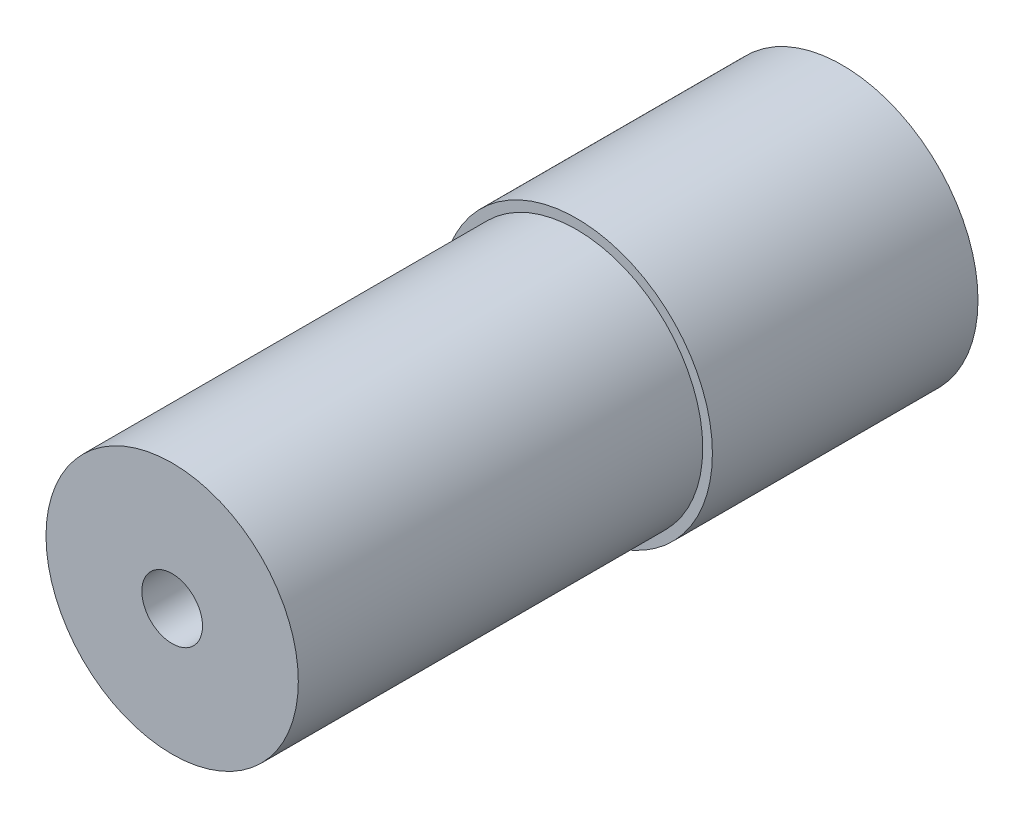
ISO-10303-21;
HEADER;
FILE_DESCRIPTION(('STEP AP214'),'2;1');
FILE_NAME('part.step','',(''),(''),'','','');
FILE_SCHEMA(('AUTOMOTIVE_DESIGN { 1 0 10303 214 1 1 1 1 }'));
ENDSEC;
DATA;
#1=APPLICATION_CONTEXT('core data for automotive mechanical design processes');
#2=APPLICATION_PROTOCOL_DEFINITION('international standard','automotive_design',2000,#1);
#3=PRODUCT_CONTEXT('',#1,'mechanical');
#4=PRODUCT('Part','Part','',(#3));
#5=PRODUCT_RELATED_PRODUCT_CATEGORY('part','',(#4));
#6=PRODUCT_DEFINITION_FORMATION('','',#4);
#7=PRODUCT_DEFINITION_CONTEXT('part definition',#1,'design');
#8=PRODUCT_DEFINITION('design','',#6,#7);
#9=PRODUCT_DEFINITION_SHAPE('','',#8);
#10=(LENGTH_UNIT() NAMED_UNIT(*) SI_UNIT(.MILLI.,.METRE.));
#11=(NAMED_UNIT(*) PLANE_ANGLE_UNIT() SI_UNIT($,.RADIAN.));
#12=(NAMED_UNIT(*) SI_UNIT($,.STERADIAN.) SOLID_ANGLE_UNIT());
#13=UNCERTAINTY_MEASURE_WITH_UNIT(LENGTH_MEASURE(1.E-05),#10,'distance_accuracy_value','');
#14=(GEOMETRIC_REPRESENTATION_CONTEXT(3) GLOBAL_UNCERTAINTY_ASSIGNED_CONTEXT((#13)) GLOBAL_UNIT_ASSIGNED_CONTEXT((#10,
#11,#12)) REPRESENTATION_CONTEXT('',''));
#15=CARTESIAN_POINT('',(0.,0.,0.));
#16=DIRECTION('',(0.,0.,1.));
#17=DIRECTION('',(1.,0.,0.));
#18=AXIS2_PLACEMENT_3D('',#15,#16,#17);
#19=CARTESIAN_POINT('',(0.,0.,44.));
#20=DIRECTION('',(0.,0.,1.));
#21=DIRECTION('',(1.,0.,0.));
#22=AXIS2_PLACEMENT_3D('',#19,#20,#21);
#23=PLANE('',#22);
#24=CARTESIAN_POINT('',(0.,0.,44.));
#25=DIRECTION('',(0.,0.,1.));
#26=DIRECTION('',(1.,0.,0.));
#27=AXIS2_PLACEMENT_3D('',#24,#25,#26);
#28=CIRCLE('',#27,22.5);
#29=CARTESIAN_POINT('',(22.5,0.,44.));
#30=VERTEX_POINT('',#29);
#31=EDGE_CURVE('E83',#30,#30,#28,.T.);
#32=ORIENTED_EDGE('',*,*,#31,.T.);
#33=EDGE_LOOP('',(#32));
#34=FACE_BOUND('',#33,.T.);
#35=CARTESIAN_POINT('',(0.,0.,44.));
#36=DIRECTION('',(0.,0.,1.));
#37=DIRECTION('',(1.,0.,0.));
#38=AXIS2_PLACEMENT_3D('',#35,#36,#37);
#39=CIRCLE('',#38,20.9);
#40=CARTESIAN_POINT('',(20.9,0.,44.));
#41=VERTEX_POINT('',#40);
#42=EDGE_CURVE('E123',#41,#41,#39,.T.);
#43=ORIENTED_EDGE('',*,*,#42,.F.);
#44=EDGE_LOOP('',(#43));
#45=FACE_BOUND('',#44,.T.);
#46=ADVANCED_FACE('F45',(#34,#45),#23,.T.);
#47=CARTESIAN_POINT('',(0.,0.,0.));
#48=DIRECTION('',(0.,0.,1.));
#49=DIRECTION('',(1.,0.,0.));
#50=AXIS2_PLACEMENT_3D('',#47,#48,#49);
#51=PLANE('',#50);
#52=CARTESIAN_POINT('',(17.5,2.42861286636753E-13,0.));
#53=DIRECTION('',(0.,0.,1.));
#54=DIRECTION('',(1.,0.,0.));
#55=AXIS2_PLACEMENT_3D('',#52,#53,#54);
#56=CIRCLE('',#55,1.5);
#57=CARTESIAN_POINT('',(19.,2.42861286636753E-13,0.));
#58=VERTEX_POINT('',#57);
#59=EDGE_CURVE('E49',#58,#58,#56,.T.);
#60=ORIENTED_EDGE('',*,*,#59,.T.);
#61=EDGE_LOOP('',(#60));
#62=FACE_BOUND('',#61,.T.);
#63=CARTESIAN_POINT('',(1.17961196366423E-13,-17.4999999999999,0.));
#64=DIRECTION('',(0.,0.,1.));
#65=DIRECTION('',(1.,0.,0.));
#66=AXIS2_PLACEMENT_3D('',#63,#64,#65);
#67=CIRCLE('',#66,1.5);
#68=CARTESIAN_POINT('',(1.50000000000012,-17.4999999999999,0.));
#69=VERTEX_POINT('',#68);
#70=EDGE_CURVE('E100',#69,#69,#67,.T.);
#71=ORIENTED_EDGE('',*,*,#70,.T.);
#72=EDGE_LOOP('',(#71));
#73=FACE_BOUND('',#72,.T.);
#74=CARTESIAN_POINT('',(-17.5,0.,0.));
#75=DIRECTION('',(0.,0.,1.));
#76=DIRECTION('',(1.,0.,0.));
#77=AXIS2_PLACEMENT_3D('',#74,#75,#76);
#78=CIRCLE('',#77,1.5);
#79=CARTESIAN_POINT('',(-16.,0.,0.));
#80=VERTEX_POINT('',#79);
#81=EDGE_CURVE('E104',#80,#80,#78,.T.);
#82=ORIENTED_EDGE('',*,*,#81,.T.);
#83=EDGE_LOOP('',(#82));
#84=FACE_BOUND('',#83,.T.);
#85=CARTESIAN_POINT('',(-1.17961196366423E-13,17.5000000000001,0.));
#86=DIRECTION('',(0.,0.,1.));
#87=DIRECTION('',(1.,0.,0.));
#88=AXIS2_PLACEMENT_3D('',#85,#86,#87);
#89=CIRCLE('',#88,1.5);
#90=CARTESIAN_POINT('',(1.49999999999988,17.5000000000001,0.));
#91=VERTEX_POINT('',#90);
#92=EDGE_CURVE('E108',#91,#91,#89,.T.);
#93=ORIENTED_EDGE('',*,*,#92,.T.);
#94=EDGE_LOOP('',(#93));
#95=FACE_BOUND('',#94,.T.);
#96=CARTESIAN_POINT('',(0.,0.,0.));
#97=DIRECTION('',(0.,0.,1.));
#98=DIRECTION('',(1.,0.,0.));
#99=AXIS2_PLACEMENT_3D('',#96,#97,#98);
#100=CIRCLE('',#99,13.);
#101=CARTESIAN_POINT('',(-9.19238815542514,-9.1923881554251,0.));
#102=VERTEX_POINT('',#101);
#103=CARTESIAN_POINT('',(-9.1923881554251,9.19238815542514,0.));
#104=VERTEX_POINT('',#103);
#105=EDGE_CURVE('E56',#102,#104,#100,.F.);
#106=ORIENTED_EDGE('',*,*,#105,.F.);
#107=CARTESIAN_POINT('',(-12.3743686707645,-12.3743686707644,0.));
#108=DIRECTION('',(0.,0.,1.));
#109=DIRECTION('',(1.,0.,0.));
#110=AXIS2_PLACEMENT_3D('',#107,#108,#109);
#111=CIRCLE('',#110,4.5);
#112=EDGE_CURVE('E61',#102,#102,#111,.T.);
#113=ORIENTED_EDGE('',*,*,#112,.T.);
#114=CARTESIAN_POINT('',(9.19238815542519,-9.19238815542505,0.));
#115=VERTEX_POINT('',#114);
#116=EDGE_CURVE('E80',#115,#102,#100,.F.);
#117=ORIENTED_EDGE('',*,*,#116,.F.);
#118=CARTESIAN_POINT('',(12.3743686707646,-12.3743686707644,0.));
#119=DIRECTION('',(0.,0.,1.));
#120=DIRECTION('',(1.,0.,0.));
#121=AXIS2_PLACEMENT_3D('',#118,#119,#120);
#122=CIRCLE('',#121,4.5);
#123=EDGE_CURVE('E66',#115,#115,#122,.T.);
#124=ORIENTED_EDGE('',*,*,#123,.T.);
#125=CARTESIAN_POINT('',(9.19238815542505,9.19238815542519,0.));
#126=VERTEX_POINT('',#125);
#127=EDGE_CURVE('E54',#126,#115,#100,.F.);
#128=ORIENTED_EDGE('',*,*,#127,.F.);
#129=CARTESIAN_POINT('',(12.3743686707645,12.3743686707647,0.));
#130=DIRECTION('',(0.,0.,1.));
#131=DIRECTION('',(1.,0.,0.));
#132=AXIS2_PLACEMENT_3D('',#129,#130,#131);
#133=CIRCLE('',#132,4.5);
#134=EDGE_CURVE('E93',#126,#126,#133,.T.);
#135=ORIENTED_EDGE('',*,*,#134,.T.);
#136=EDGE_CURVE('E13',#104,#126,#100,.F.);
#137=ORIENTED_EDGE('',*,*,#136,.F.);
#138=CARTESIAN_POINT('',(-12.3743686707646,12.3743686707646,0.));
#139=DIRECTION('',(0.,0.,1.));
#140=DIRECTION('',(1.,0.,0.));
#141=AXIS2_PLACEMENT_3D('',#138,#139,#140);
#142=CIRCLE('',#141,4.5);
#143=EDGE_CURVE('E85',#104,#104,#142,.T.);
#144=ORIENTED_EDGE('',*,*,#143,.T.);
#145=EDGE_LOOP('',(#106,#113,#117,#124,#128,#135,#137,#144));
#146=FACE_BOUND('',#145,.T.);
#147=CARTESIAN_POINT('',(0.,0.,0.));
#148=DIRECTION('',(0.,0.,1.));
#149=DIRECTION('',(1.,0.,0.));
#150=AXIS2_PLACEMENT_3D('',#147,#148,#149);
#151=CIRCLE('',#150,22.5);
#152=CARTESIAN_POINT('',(22.5,0.,0.));
#153=VERTEX_POINT('',#152);
#154=EDGE_CURVE('E126',#153,#153,#151,.T.);
#155=ORIENTED_EDGE('',*,*,#154,.F.);
#156=EDGE_LOOP('',(#155));
#157=FACE_BOUND('',#156,.T.);
#158=ADVANCED_FACE('F141',(#62,#73,#84,#95,#146,#157),#51,.F.);
#159=CARTESIAN_POINT('',(0.,0.,44.));
#160=DIRECTION('',(0.,0.,-1.));
#161=DIRECTION('',(-1.,0.,0.));
#162=AXIS2_PLACEMENT_3D('',#159,#160,#161);
#163=CYLINDRICAL_SURFACE('',#162,22.5);
#164=ORIENTED_EDGE('',*,*,#31,.F.);
#165=EDGE_LOOP('',(#164));
#166=FACE_BOUND('',#165,.T.);
#167=ORIENTED_EDGE('',*,*,#154,.T.);
#168=EDGE_LOOP('',(#167));
#169=FACE_BOUND('',#168,.T.);
#170=ADVANCED_FACE('F47',(#166,#169),#163,.T.);
#171=CARTESIAN_POINT('',(0.,0.,111.));
#172=DIRECTION('',(0.,0.,-1.));
#173=DIRECTION('',(-1.,0.,0.));
#174=AXIS2_PLACEMENT_3D('',#171,#172,#173);
#175=CYLINDRICAL_SURFACE('',#174,20.9);
#176=ORIENTED_EDGE('',*,*,#42,.T.);
#177=EDGE_LOOP('',(#176));
#178=FACE_BOUND('',#177,.T.);
#179=CARTESIAN_POINT('',(0.,0.,111.));
#180=DIRECTION('',(0.,0.,1.));
#181=DIRECTION('',(1.,0.,0.));
#182=AXIS2_PLACEMENT_3D('',#179,#180,#181);
#183=CIRCLE('',#182,20.9);
#184=CARTESIAN_POINT('',(20.9,0.,111.));
#185=VERTEX_POINT('',#184);
#186=EDGE_CURVE('E120',#185,#185,#183,.T.);
#187=ORIENTED_EDGE('',*,*,#186,.F.);
#188=EDGE_LOOP('',(#187));
#189=FACE_BOUND('',#188,.T.);
#190=ADVANCED_FACE('F170',(#178,#189),#175,.T.);
#191=CARTESIAN_POINT('',(0.,0.,111.));
#192=DIRECTION('',(0.,0.,1.));
#193=DIRECTION('',(1.,0.,0.));
#194=AXIS2_PLACEMENT_3D('',#191,#192,#193);
#195=PLANE('',#194);
#196=CARTESIAN_POINT('',(0.,0.,111.));
#197=DIRECTION('',(0.,0.,1.));
#198=DIRECTION('',(1.,0.,0.));
#199=AXIS2_PLACEMENT_3D('',#196,#197,#198);
#200=CIRCLE('',#199,5.025);
#201=CARTESIAN_POINT('',(5.025,0.,111.));
#202=VERTEX_POINT('',#201);
#203=EDGE_CURVE('E119',#202,#202,#200,.T.);
#204=ORIENTED_EDGE('',*,*,#203,.F.);
#205=EDGE_LOOP('',(#204));
#206=FACE_BOUND('',#205,.T.);
#207=ORIENTED_EDGE('',*,*,#186,.T.);
#208=EDGE_LOOP('',(#207));
#209=FACE_BOUND('',#208,.T.);
#210=ADVANCED_FACE('F173',(#206,#209),#195,.T.);
#211=CARTESIAN_POINT('',(0.,0.,171.));
#212=DIRECTION('',(0.,0.,-1.));
#213=DIRECTION('',(-1.,0.,0.));
#214=AXIS2_PLACEMENT_3D('',#211,#212,#213);
#215=CYLINDRICAL_SURFACE('',#214,5.025);
#216=ORIENTED_EDGE('',*,*,#203,.T.);
#217=EDGE_LOOP('',(#216));
#218=FACE_BOUND('',#217,.T.);
#219=CARTESIAN_POINT('',(0.,0.,0.));
#220=DIRECTION('',(0.,0.,-1.));
#221=DIRECTION('',(-1.,0.,0.));
#222=AXIS2_PLACEMENT_3D('',#219,#220,#221);
#223=CIRCLE('',#222,5.025);
#224=CARTESIAN_POINT('',(-5.025,0.,0.));
#225=VERTEX_POINT('',#224);
#226=EDGE_CURVE('E116',#225,#225,#223,.F.);
#227=ORIENTED_EDGE('',*,*,#226,.F.);
#228=EDGE_LOOP('',(#227));
#229=FACE_BOUND('',#228,.T.);
#230=ADVANCED_FACE('F177',(#218,#229),#215,.F.);
#231=CARTESIAN_POINT('',(0.,0.,0.));
#232=DIRECTION('',(0.,0.,-1.));
#233=DIRECTION('',(-1.,0.,0.));
#234=AXIS2_PLACEMENT_3D('',#231,#232,#233);
#235=PLANE('',#234);
#236=CARTESIAN_POINT('',(0.,0.,0.));
#237=DIRECTION('',(0.,0.,-1.));
#238=DIRECTION('',(-1.,0.,0.));
#239=AXIS2_PLACEMENT_3D('',#236,#237,#238);
#240=CIRCLE('',#239,5.);
#241=CARTESIAN_POINT('',(-5.,0.,0.));
#242=VERTEX_POINT('',#241);
#243=EDGE_CURVE('E109',#242,#242,#240,.T.);
#244=ORIENTED_EDGE('',*,*,#243,.T.);
#245=EDGE_LOOP('',(#244));
#246=FACE_BOUND('',#245,.T.);
#247=ORIENTED_EDGE('',*,*,#226,.T.);
#248=EDGE_LOOP('',(#247));
#249=FACE_BOUND('',#248,.T.);
#250=ADVANCED_FACE('F181',(#246,#249),#235,.F.);
#251=CARTESIAN_POINT('',(0.,0.,-2.));
#252=DIRECTION('',(0.,0.,1.));
#253=DIRECTION('',(1.,0.,0.));
#254=AXIS2_PLACEMENT_3D('',#251,#252,#253);
#255=CYLINDRICAL_SURFACE('',#254,13.);
#256=CARTESIAN_POINT('',(0.,0.,-2.));
#257=DIRECTION('',(0.,0.,-1.));
#258=DIRECTION('',(-1.,0.,0.));
#259=AXIS2_PLACEMENT_3D('',#256,#257,#258);
#260=CIRCLE('',#259,13.);
#261=CARTESIAN_POINT('',(-13.,0.,-2.));
#262=VERTEX_POINT('',#261);
#263=EDGE_CURVE('E113',#262,#262,#260,.T.);
#264=ORIENTED_EDGE('',*,*,#263,.F.);
#265=EDGE_LOOP('',(#264));
#266=FACE_BOUND('',#265,.T.);
#267=ORIENTED_EDGE('',*,*,#136,.T.);
#268=ORIENTED_EDGE('',*,*,#127,.T.);
#269=ORIENTED_EDGE('',*,*,#116,.T.);
#270=ORIENTED_EDGE('',*,*,#105,.T.);
#271=EDGE_LOOP('',(#267,#268,#269,#270));
#272=FACE_BOUND('',#271,.T.);
#273=ADVANCED_FACE('F76',(#266,#272),#255,.T.);
#274=CARTESIAN_POINT('',(0.,0.,-2.));
#275=DIRECTION('',(0.,0.,-1.));
#276=DIRECTION('',(-1.,0.,0.));
#277=AXIS2_PLACEMENT_3D('',#274,#275,#276);
#278=PLANE('',#277);
#279=CARTESIAN_POINT('',(0.,0.,-2.));
#280=DIRECTION('',(0.,0.,-1.));
#281=DIRECTION('',(-1.,0.,0.));
#282=AXIS2_PLACEMENT_3D('',#279,#280,#281);
#283=CIRCLE('',#282,5.);
#284=CARTESIAN_POINT('',(-5.,0.,-2.));
#285=VERTEX_POINT('',#284);
#286=EDGE_CURVE('E112',#285,#285,#283,.F.);
#287=ORIENTED_EDGE('',*,*,#286,.T.);
#288=EDGE_LOOP('',(#287));
#289=FACE_BOUND('',#288,.T.);
#290=ORIENTED_EDGE('',*,*,#263,.T.);
#291=EDGE_LOOP('',(#290));
#292=FACE_BOUND('',#291,.T.);
#293=ADVANCED_FACE('F185',(#289,#292),#278,.T.);
#294=CARTESIAN_POINT('',(0.,0.,-35.));
#295=DIRECTION('',(0.,0.,1.));
#296=DIRECTION('',(1.,0.,0.));
#297=AXIS2_PLACEMENT_3D('',#294,#295,#296);
#298=CYLINDRICAL_SURFACE('',#297,5.);
#299=ORIENTED_EDGE('',*,*,#286,.F.);
#300=EDGE_LOOP('',(#299));
#301=FACE_BOUND('',#300,.T.);
#302=ORIENTED_EDGE('',*,*,#243,.F.);
#303=EDGE_LOOP('',(#302));
#304=FACE_BOUND('',#303,.T.);
#305=ADVANCED_FACE('F192',(#301,#304),#298,.F.);
#306=CARTESIAN_POINT('',(-1.17961196366423E-13,17.5000000000001,8.00000000000001));
#307=DIRECTION('',(0.,0.,-1.));
#308=DIRECTION('',(-1.,0.,0.));
#309=AXIS2_PLACEMENT_3D('',#306,#307,#308);
#310=CYLINDRICAL_SURFACE('',#309,1.5);
#311=CARTESIAN_POINT('',(-1.17961196366423E-13,17.5000000000001,8.00000000000001));
#312=DIRECTION('',(0.,0.,-1.));
#313=DIRECTION('',(-1.,0.,0.));
#314=AXIS2_PLACEMENT_3D('',#311,#312,#313);
#315=CIRCLE('',#314,1.5);
#316=CARTESIAN_POINT('',(-1.50000000000012,17.5000000000001,8.00000000000001));
#317=VERTEX_POINT('',#316);
#318=EDGE_CURVE('E105',#317,#317,#315,.T.);
#319=ORIENTED_EDGE('',*,*,#318,.F.);
#320=EDGE_LOOP('',(#319));
#321=FACE_BOUND('',#320,.T.);
#322=ORIENTED_EDGE('',*,*,#92,.F.);
#323=EDGE_LOOP('',(#322));
#324=FACE_BOUND('',#323,.T.);
#325=ADVANCED_FACE('F196',(#321,#324),#310,.F.);
#326=CARTESIAN_POINT('',(-1.17961196366423E-13,17.5000000000001,8.00000000000001));
#327=DIRECTION('',(0.,0.,-1.));
#328=DIRECTION('',(-1.,0.,0.));
#329=AXIS2_PLACEMENT_3D('',#326,#327,#328);
#330=PLANE('',#329);
#331=ORIENTED_EDGE('',*,*,#318,.T.);
#332=EDGE_LOOP('',(#331));
#333=FACE_BOUND('',#332,.T.);
#334=ADVANCED_FACE('F200',(#333),#330,.T.);
#335=CARTESIAN_POINT('',(-17.5,0.,8.00000000000001));
#336=DIRECTION('',(0.,0.,-1.));
#337=DIRECTION('',(-1.,0.,0.));
#338=AXIS2_PLACEMENT_3D('',#335,#336,#337);
#339=CYLINDRICAL_SURFACE('',#338,1.5);
#340=CARTESIAN_POINT('',(-17.5,0.,8.00000000000001));
#341=DIRECTION('',(0.,0.,-1.));
#342=DIRECTION('',(-1.,0.,0.));
#343=AXIS2_PLACEMENT_3D('',#340,#341,#342);
#344=CIRCLE('',#343,1.5);
#345=CARTESIAN_POINT('',(-19.,0.,8.00000000000001));
#346=VERTEX_POINT('',#345);
#347=EDGE_CURVE('E101',#346,#346,#344,.T.);
#348=ORIENTED_EDGE('',*,*,#347,.F.);
#349=EDGE_LOOP('',(#348));
#350=FACE_BOUND('',#349,.T.);
#351=ORIENTED_EDGE('',*,*,#81,.F.);
#352=EDGE_LOOP('',(#351));
#353=FACE_BOUND('',#352,.T.);
#354=ADVANCED_FACE('F157',(#350,#353),#339,.F.);
#355=CARTESIAN_POINT('',(-17.5,0.,8.00000000000001));
#356=DIRECTION('',(0.,0.,-1.));
#357=DIRECTION('',(-1.,0.,0.));
#358=AXIS2_PLACEMENT_3D('',#355,#356,#357);
#359=PLANE('',#358);
#360=ORIENTED_EDGE('',*,*,#347,.T.);
#361=EDGE_LOOP('',(#360));
#362=FACE_BOUND('',#361,.T.);
#363=ADVANCED_FACE('F147',(#362),#359,.T.);
#364=CARTESIAN_POINT('',(1.17961196366423E-13,-17.4999999999999,8.00000000000001));
#365=DIRECTION('',(0.,0.,-1.));
#366=DIRECTION('',(-1.,0.,0.));
#367=AXIS2_PLACEMENT_3D('',#364,#365,#366);
#368=CYLINDRICAL_SURFACE('',#367,1.5);
#369=CARTESIAN_POINT('',(1.17961196366423E-13,-17.4999999999999,8.00000000000001));
#370=DIRECTION('',(0.,0.,-1.));
#371=DIRECTION('',(-1.,0.,0.));
#372=AXIS2_PLACEMENT_3D('',#369,#370,#371);
#373=CIRCLE('',#372,1.5);
#374=CARTESIAN_POINT('',(-1.49999999999988,-17.4999999999999,8.00000000000001));
#375=VERTEX_POINT('',#374);
#376=EDGE_CURVE('E97',#375,#375,#373,.T.);
#377=ORIENTED_EDGE('',*,*,#376,.F.);
#378=EDGE_LOOP('',(#377));
#379=FACE_BOUND('',#378,.T.);
#380=ORIENTED_EDGE('',*,*,#70,.F.);
#381=EDGE_LOOP('',(#380));
#382=FACE_BOUND('',#381,.T.);
#383=ADVANCED_FACE('F144',(#379,#382),#368,.F.);
#384=CARTESIAN_POINT('',(1.17961196366423E-13,-17.4999999999999,8.00000000000001));
#385=DIRECTION('',(0.,0.,-1.));
#386=DIRECTION('',(-1.,0.,0.));
#387=AXIS2_PLACEMENT_3D('',#384,#385,#386);
#388=PLANE('',#387);
#389=ORIENTED_EDGE('',*,*,#376,.T.);
#390=EDGE_LOOP('',(#389));
#391=FACE_BOUND('',#390,.T.);
#392=ADVANCED_FACE('F146',(#391),#388,.T.);
#393=CARTESIAN_POINT('',(17.5,2.42861286636753E-13,8.00000000000001));
#394=DIRECTION('',(0.,0.,-1.));
#395=DIRECTION('',(-1.,0.,0.));
#396=AXIS2_PLACEMENT_3D('',#393,#394,#395);
#397=CYLINDRICAL_SURFACE('',#396,1.5);
#398=CARTESIAN_POINT('',(17.5,2.42861286636753E-13,8.00000000000001));
#399=DIRECTION('',(0.,0.,-1.));
#400=DIRECTION('',(-1.,0.,0.));
#401=AXIS2_PLACEMENT_3D('',#398,#399,#400);
#402=CIRCLE('',#401,1.5);
#403=CARTESIAN_POINT('',(16.,2.42861286636753E-13,8.00000000000001));
#404=VERTEX_POINT('',#403);
#405=EDGE_CURVE('E87',#404,#404,#402,.T.);
#406=ORIENTED_EDGE('',*,*,#405,.F.);
#407=EDGE_LOOP('',(#406));
#408=FACE_BOUND('',#407,.T.);
#409=ORIENTED_EDGE('',*,*,#59,.F.);
#410=EDGE_LOOP('',(#409));
#411=FACE_BOUND('',#410,.T.);
#412=ADVANCED_FACE('F154',(#408,#411),#397,.F.);
#413=CARTESIAN_POINT('',(17.5,2.42861286636753E-13,8.00000000000001));
#414=DIRECTION('',(0.,0.,-1.));
#415=DIRECTION('',(-1.,0.,0.));
#416=AXIS2_PLACEMENT_3D('',#413,#414,#415);
#417=PLANE('',#416);
#418=ORIENTED_EDGE('',*,*,#405,.T.);
#419=EDGE_LOOP('',(#418));
#420=FACE_BOUND('',#419,.T.);
#421=ADVANCED_FACE('F280',(#420),#417,.T.);
#422=CARTESIAN_POINT('',(-12.3743686707646,12.3743686707646,2.));
#423=DIRECTION('',(0.,0.,-1.));
#424=DIRECTION('',(-1.,0.,0.));
#425=AXIS2_PLACEMENT_3D('',#422,#423,#424);
#426=CYLINDRICAL_SURFACE('',#425,4.5);
#427=CARTESIAN_POINT('',(-12.3743686707646,12.3743686707646,2.));
#428=DIRECTION('',(0.,0.,-1.));
#429=DIRECTION('',(-1.,0.,0.));
#430=AXIS2_PLACEMENT_3D('',#427,#428,#429);
#431=CIRCLE('',#430,4.5);
#432=CARTESIAN_POINT('',(-16.8743686707646,12.3743686707646,2.));
#433=VERTEX_POINT('',#432);
#434=EDGE_CURVE('E88',#433,#433,#431,.T.);
#435=ORIENTED_EDGE('',*,*,#434,.F.);
#436=EDGE_LOOP('',(#435));
#437=FACE_BOUND('',#436,.T.);
#438=ORIENTED_EDGE('',*,*,#143,.F.);
#439=EDGE_LOOP('',(#438));
#440=FACE_BOUND('',#439,.T.);
#441=ADVANCED_FACE('F86',(#437,#440),#426,.F.);
#442=CARTESIAN_POINT('',(-12.3743686707646,12.3743686707646,2.));
#443=DIRECTION('',(0.,0.,-1.));
#444=DIRECTION('',(-1.,0.,0.));
#445=AXIS2_PLACEMENT_3D('',#442,#443,#444);
#446=PLANE('',#445);
#447=ORIENTED_EDGE('',*,*,#434,.T.);
#448=EDGE_LOOP('',(#447));
#449=FACE_BOUND('',#448,.T.);
#450=ADVANCED_FACE('F295',(#449),#446,.T.);
#451=CARTESIAN_POINT('',(12.3743686707645,12.3743686707647,2.));
#452=DIRECTION('',(0.,0.,-1.));
#453=DIRECTION('',(-1.,0.,0.));
#454=AXIS2_PLACEMENT_3D('',#451,#452,#453);
#455=CYLINDRICAL_SURFACE('',#454,4.5);
#456=CARTESIAN_POINT('',(12.3743686707645,12.3743686707647,2.));
#457=DIRECTION('',(0.,0.,-1.));
#458=DIRECTION('',(-1.,0.,0.));
#459=AXIS2_PLACEMENT_3D('',#456,#457,#458);
#460=CIRCLE('',#459,4.5);
#461=CARTESIAN_POINT('',(7.87436867076448,12.3743686707647,2.));
#462=VERTEX_POINT('',#461);
#463=EDGE_CURVE('E363',#462,#462,#460,.T.);
#464=ORIENTED_EDGE('',*,*,#463,.F.);
#465=EDGE_LOOP('',(#464));
#466=FACE_BOUND('',#465,.T.);
#467=ORIENTED_EDGE('',*,*,#134,.F.);
#468=EDGE_LOOP('',(#467));
#469=FACE_BOUND('',#468,.T.);
#470=ADVANCED_FACE('F303',(#466,#469),#455,.F.);
#471=CARTESIAN_POINT('',(12.3743686707645,12.3743686707647,2.));
#472=DIRECTION('',(0.,0.,-1.));
#473=DIRECTION('',(-1.,0.,0.));
#474=AXIS2_PLACEMENT_3D('',#471,#472,#473);
#475=PLANE('',#474);
#476=ORIENTED_EDGE('',*,*,#463,.T.);
#477=EDGE_LOOP('',(#476));
#478=FACE_BOUND('',#477,.T.);
#479=ADVANCED_FACE('F311',(#478),#475,.T.);
#480=CARTESIAN_POINT('',(12.3743686707646,-12.3743686707644,2.));
#481=DIRECTION('',(0.,0.,-1.));
#482=DIRECTION('',(-1.,0.,0.));
#483=AXIS2_PLACEMENT_3D('',#480,#481,#482);
#484=CYLINDRICAL_SURFACE('',#483,4.5);
#485=CARTESIAN_POINT('',(12.3743686707646,-12.3743686707644,2.));
#486=DIRECTION('',(0.,0.,-1.));
#487=DIRECTION('',(-1.,0.,0.));
#488=AXIS2_PLACEMENT_3D('',#485,#486,#487);
#489=CIRCLE('',#488,4.5);
#490=CARTESIAN_POINT('',(7.87436867076455,-12.3743686707644,2.));
#491=VERTEX_POINT('',#490);
#492=EDGE_CURVE('E357',#491,#491,#489,.T.);
#493=ORIENTED_EDGE('',*,*,#492,.F.);
#494=EDGE_LOOP('',(#493));
#495=FACE_BOUND('',#494,.T.);
#496=ORIENTED_EDGE('',*,*,#123,.F.);
#497=EDGE_LOOP('',(#496));
#498=FACE_BOUND('',#497,.T.);
#499=ADVANCED_FACE('F319',(#495,#498),#484,.F.);
#500=CARTESIAN_POINT('',(12.3743686707646,-12.3743686707644,2.));
#501=DIRECTION('',(0.,0.,-1.));
#502=DIRECTION('',(-1.,0.,0.));
#503=AXIS2_PLACEMENT_3D('',#500,#501,#502);
#504=PLANE('',#503);
#505=ORIENTED_EDGE('',*,*,#492,.T.);
#506=EDGE_LOOP('',(#505));
#507=FACE_BOUND('',#506,.T.);
#508=ADVANCED_FACE('F327',(#507),#504,.T.);
#509=CARTESIAN_POINT('',(-12.3743686707645,-12.3743686707644,2.));
#510=DIRECTION('',(0.,0.,-1.));
#511=DIRECTION('',(-1.,0.,0.));
#512=AXIS2_PLACEMENT_3D('',#509,#510,#511);
#513=CYLINDRICAL_SURFACE('',#512,4.5);
#514=CARTESIAN_POINT('',(-12.3743686707645,-12.3743686707644,2.));
#515=DIRECTION('',(0.,0.,-1.));
#516=DIRECTION('',(-1.,0.,0.));
#517=AXIS2_PLACEMENT_3D('',#514,#515,#516);
#518=CIRCLE('',#517,4.5);
#519=CARTESIAN_POINT('',(-16.8743686707645,-12.3743686707644,2.));
#520=VERTEX_POINT('',#519);
#521=EDGE_CURVE('E355',#520,#520,#518,.T.);
#522=ORIENTED_EDGE('',*,*,#521,.F.);
#523=EDGE_LOOP('',(#522));
#524=FACE_BOUND('',#523,.T.);
#525=ORIENTED_EDGE('',*,*,#112,.F.);
#526=EDGE_LOOP('',(#525));
#527=FACE_BOUND('',#526,.T.);
#528=ADVANCED_FACE('F335',(#524,#527),#513,.F.);
#529=CARTESIAN_POINT('',(-12.3743686707645,-12.3743686707644,2.));
#530=DIRECTION('',(0.,0.,-1.));
#531=DIRECTION('',(-1.,0.,0.));
#532=AXIS2_PLACEMENT_3D('',#529,#530,#531);
#533=PLANE('',#532);
#534=ORIENTED_EDGE('',*,*,#521,.T.);
#535=EDGE_LOOP('',(#534));
#536=FACE_BOUND('',#535,.T.);
#537=ADVANCED_FACE('F343',(#536),#533,.T.);
#538=CLOSED_SHELL('',(#46,#158,#170,#190,#210,#230,#250,#273,#293,#305,#325,#334,#354,#363,#383,
#392,#412,#421,#441,#450,#470,#479,#499,#508,#528,#537));
#539=MANIFOLD_SOLID_BREP('B2',#538);
#540=ADVANCED_BREP_SHAPE_REPRESENTATION('',(#18,#539),#14);
#541=SHAPE_DEFINITION_REPRESENTATION(#9,#540);
ENDSEC;
END-ISO-10303-21;
